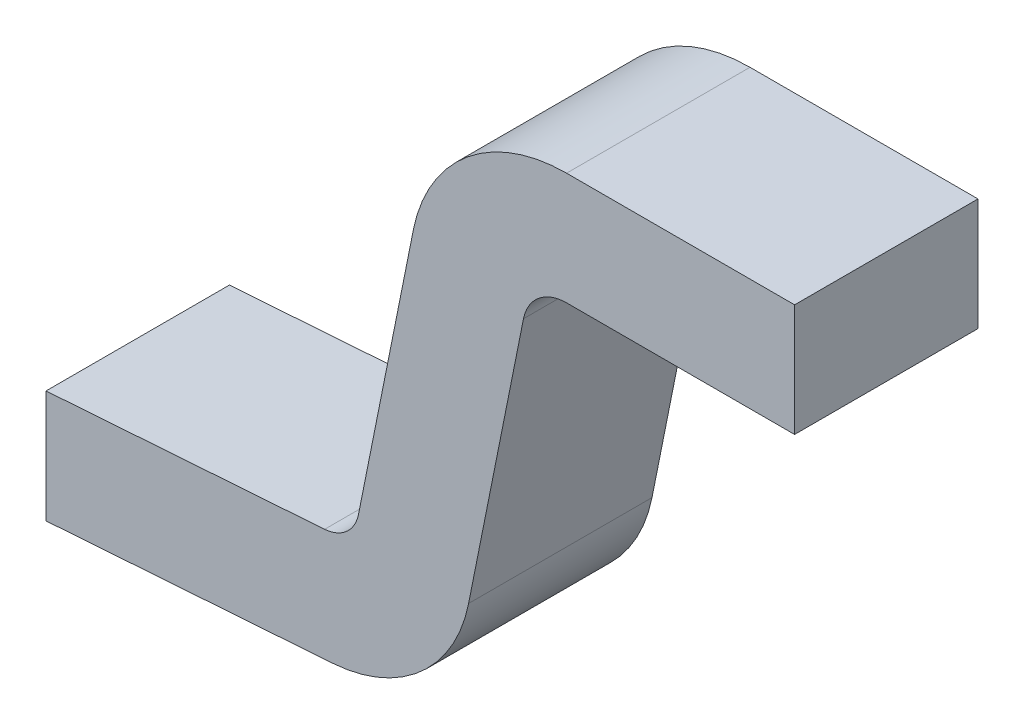
ISO-10303-21;
HEADER;
FILE_DESCRIPTION(('STEP AP214'),'2;1');
FILE_NAME('part.step','',(''),(''),'','','');
FILE_SCHEMA(('AUTOMOTIVE_DESIGN { 1 0 10303 214 1 1 1 1 }'));
ENDSEC;
DATA;
#1=APPLICATION_CONTEXT('core data for automotive mechanical design processes');
#2=APPLICATION_PROTOCOL_DEFINITION('international standard','automotive_design',2000,#1);
#3=PRODUCT_CONTEXT('',#1,'mechanical');
#4=PRODUCT('Part','Part','',(#3));
#5=PRODUCT_RELATED_PRODUCT_CATEGORY('part','',(#4));
#6=PRODUCT_DEFINITION_FORMATION('','',#4);
#7=PRODUCT_DEFINITION_CONTEXT('part definition',#1,'design');
#8=PRODUCT_DEFINITION('design','',#6,#7);
#9=PRODUCT_DEFINITION_SHAPE('','',#8);
#10=(LENGTH_UNIT() NAMED_UNIT(*) SI_UNIT(.MILLI.,.METRE.));
#11=(NAMED_UNIT(*) PLANE_ANGLE_UNIT() SI_UNIT($,.RADIAN.));
#12=(NAMED_UNIT(*) SI_UNIT($,.STERADIAN.) SOLID_ANGLE_UNIT());
#13=UNCERTAINTY_MEASURE_WITH_UNIT(LENGTH_MEASURE(1.E-05),#10,'distance_accuracy_value','');
#14=(GEOMETRIC_REPRESENTATION_CONTEXT(3) GLOBAL_UNCERTAINTY_ASSIGNED_CONTEXT((#13)) GLOBAL_UNIT_ASSIGNED_CONTEXT((#10,
#11,#12)) REPRESENTATION_CONTEXT('',''));
#15=CARTESIAN_POINT('',(0.,0.,0.));
#16=DIRECTION('',(0.,0.,1.));
#17=DIRECTION('',(1.,0.,0.));
#18=AXIS2_PLACEMENT_3D('',#15,#16,#17);
#19=CARTESIAN_POINT('',(-0.127804391765579,-0.198607262984615,0.));
#20=DIRECTION('',(0.069756473744126,-0.997564050259824,0.));
#21=DIRECTION('',(-0.997564050259824,-0.069756473744126,0.));
#22=AXIS2_PLACEMENT_3D('',#19,#20,#21);
#23=PLANE('',#22);
#24=DIRECTION('',(-0.997564050259824,-0.069756473744126,0.));
#25=VECTOR('',#24,1.);
#26=CARTESIAN_POINT('',(-0.127804391765579,-0.198607262984615,0.));
#27=LINE('',#26,#25);
#28=CARTESIAN_POINT('',(-0.127804391765579,-0.198607262984615,0.));
#29=VERTEX_POINT('',#28);
#30=CARTESIAN_POINT('',(-0.5,-0.224633715287824,0.));
#31=VERTEX_POINT('',#30);
#32=EDGE_CURVE('E11',#29,#31,#27,.T.);
#33=ORIENTED_EDGE('',*,*,#32,.F.);
#34=DIRECTION('',(0.,0.,-1.));
#35=VECTOR('',#34,1.);
#36=CARTESIAN_POINT('',(-0.127804391765579,-0.198607262984615,0.));
#37=LINE('',#36,#35);
#38=CARTESIAN_POINT('',(-0.127804391765579,-0.198607262984615,-0.245));
#39=VERTEX_POINT('',#38);
#40=EDGE_CURVE('E23',#29,#39,#37,.T.);
#41=ORIENTED_EDGE('',*,*,#40,.T.);
#42=DIRECTION('',(-0.997564050259824,-0.069756473744126,0.));
#43=VECTOR('',#42,1.);
#44=CARTESIAN_POINT('',(-0.127804391765579,-0.198607262984615,-0.245));
#45=LINE('',#44,#43);
#46=CARTESIAN_POINT('',(-0.5,-0.224633715287824,-0.245));
#47=VERTEX_POINT('',#46);
#48=EDGE_CURVE('E202',#39,#47,#45,.T.);
#49=ORIENTED_EDGE('',*,*,#48,.T.);
#50=DIRECTION('',(0.,0.,-1.));
#51=VECTOR('',#50,1.);
#52=CARTESIAN_POINT('',(-0.5,-0.224633715287824,0.));
#53=LINE('',#52,#51);
#54=EDGE_CURVE('E199',#31,#47,#53,.T.);
#55=ORIENTED_EDGE('',*,*,#54,.F.);
#56=EDGE_LOOP('',(#33,#41,#49,#55));
#57=FACE_BOUND('',#56,.T.);
#58=ADVANCED_FACE('F16',(#57),#23,.F.);
#59=CARTESIAN_POINT('',(-0.131269254830082,-0.149057412673945,0.));
#60=DIRECTION('',(0.,0.,1.));
#61=DIRECTION('',(-0.069756473744126,0.997564050259824,0.));
#62=AXIS2_PLACEMENT_3D('',#59,#60,#61);
#63=CYLINDRICAL_SURFACE('',#62,0.0496708459950664);
#64=CARTESIAN_POINT('',(-0.131269254830082,-0.149057412673945,0.));
#65=DIRECTION('',(0.,0.,-1.));
#66=DIRECTION('',(-0.069756473744126,0.997564050259824,0.));
#67=AXIS2_PLACEMENT_3D('',#64,#65,#66);
#68=CIRCLE('',#67,0.0496708459950664);
#69=CARTESIAN_POINT('',(-0.0825658942513528,-0.158813211472806,0.));
#70=VERTEX_POINT('',#69);
#71=EDGE_CURVE('E197',#70,#29,#68,.T.);
#72=ORIENTED_EDGE('',*,*,#71,.F.);
#73=DIRECTION('',(0.,0.,-1.));
#74=VECTOR('',#73,1.);
#75=CARTESIAN_POINT('',(-0.0825658942513528,-0.158813211472806,0.));
#76=LINE('',#75,#74);
#77=CARTESIAN_POINT('',(-0.0825658942513528,-0.158813211472806,-0.245));
#78=VERTEX_POINT('',#77);
#79=EDGE_CURVE('E194',#70,#78,#76,.T.);
#80=ORIENTED_EDGE('',*,*,#79,.T.);
#81=CARTESIAN_POINT('',(-0.131269254830082,-0.149057412673945,-0.245));
#82=DIRECTION('',(0.,0.,-1.));
#83=DIRECTION('',(-0.069756473744126,0.997564050259824,0.));
#84=AXIS2_PLACEMENT_3D('',#81,#82,#83);
#85=CIRCLE('',#84,0.0496708459950664);
#86=EDGE_CURVE('E191',#78,#39,#85,.T.);
#87=ORIENTED_EDGE('',*,*,#86,.T.);
#88=ORIENTED_EDGE('',*,*,#40,.F.);
#89=EDGE_LOOP('',(#72,#80,#87,#88));
#90=FACE_BOUND('',#89,.T.);
#91=ADVANCED_FACE('F208',(#90),#63,.F.);
#92=CARTESIAN_POINT('',(-0.00923430841156182,0.207276202690008,0.));
#93=DIRECTION('',(0.980522066879372,-0.196408951839279,0.));
#94=DIRECTION('',(-0.196408951839279,-0.980522066879372,0.));
#95=AXIS2_PLACEMENT_3D('',#92,#93,#94);
#96=PLANE('',#95);
#97=DIRECTION('',(-0.196408951839279,-0.980522066879372,0.));
#98=VECTOR('',#97,1.);
#99=CARTESIAN_POINT('',(-0.00923430841156182,0.207276202690008,0.));
#100=LINE('',#99,#98);
#101=CARTESIAN_POINT('',(-0.00923430841156182,0.207276202690008,0.));
#102=VERTEX_POINT('',#101);
#103=EDGE_CURVE('E188',#102,#70,#100,.T.);
#104=ORIENTED_EDGE('',*,*,#103,.F.);
#105=DIRECTION('',(0.,0.,-1.));
#106=VECTOR('',#105,1.);
#107=CARTESIAN_POINT('',(-0.00923430841156182,0.207276202690008,0.));
#108=LINE('',#107,#106);
#109=CARTESIAN_POINT('',(-0.00923430841156182,0.207276202690008,-0.245));
#110=VERTEX_POINT('',#109);
#111=EDGE_CURVE('E186',#102,#110,#108,.T.);
#112=ORIENTED_EDGE('',*,*,#111,.T.);
#113=DIRECTION('',(-0.196408951839279,-0.980522066879372,0.));
#114=VECTOR('',#113,1.);
#115=CARTESIAN_POINT('',(-0.00923430841156182,0.207276202690008,-0.245));
#116=LINE('',#115,#114);
#117=EDGE_CURVE('E183',#110,#78,#116,.T.);
#118=ORIENTED_EDGE('',*,*,#117,.T.);
#119=ORIENTED_EDGE('',*,*,#79,.F.);
#120=EDGE_LOOP('',(#104,#112,#118,#119));
#121=FACE_BOUND('',#120,.T.);
#122=ADVANCED_FACE('F210',(#121),#96,.F.);
#123=CARTESIAN_POINT('',(0.195418151044853,0.166282148184849,0.));
#124=DIRECTION('',(0.,0.,1.));
#125=DIRECTION('',(0.,1.,0.));
#126=AXIS2_PLACEMENT_3D('',#123,#124,#125);
#127=CYLINDRICAL_SURFACE('',#126,0.208717851815151);
#128=CARTESIAN_POINT('',(0.195418151044853,0.166282148184849,0.));
#129=DIRECTION('',(0.,0.,1.));
#130=DIRECTION('',(0.,1.,0.));
#131=AXIS2_PLACEMENT_3D('',#128,#129,#130);
#132=CIRCLE('',#131,0.208717851815151);
#133=CARTESIAN_POINT('',(0.195418151044853,0.375,0.));
#134=VERTEX_POINT('',#133);
#135=EDGE_CURVE('E180',#134,#102,#132,.T.);
#136=ORIENTED_EDGE('',*,*,#135,.F.);
#137=DIRECTION('',(0.,0.,-1.));
#138=VECTOR('',#137,1.);
#139=CARTESIAN_POINT('',(0.195418151044853,0.375,0.));
#140=LINE('',#139,#138);
#141=CARTESIAN_POINT('',(0.195418151044853,0.375,-0.245));
#142=VERTEX_POINT('',#141);
#143=EDGE_CURVE('E178',#134,#142,#140,.T.);
#144=ORIENTED_EDGE('',*,*,#143,.T.);
#145=CARTESIAN_POINT('',(0.195418151044853,0.166282148184849,-0.245));
#146=DIRECTION('',(0.,0.,1.));
#147=DIRECTION('',(0.,1.,0.));
#148=AXIS2_PLACEMENT_3D('',#145,#146,#147);
#149=CIRCLE('',#148,0.208717851815151);
#150=EDGE_CURVE('E126',#142,#110,#149,.T.);
#151=ORIENTED_EDGE('',*,*,#150,.T.);
#152=ORIENTED_EDGE('',*,*,#111,.F.);
#153=EDGE_LOOP('',(#136,#144,#151,#152));
#154=FACE_BOUND('',#153,.T.);
#155=ADVANCED_FACE('F213',(#154),#127,.T.);
#156=CARTESIAN_POINT('',(0.195418151044853,0.166282148184849,0.));
#157=DIRECTION('',(0.,0.,1.));
#158=DIRECTION('',(0.,-1.,0.));
#159=AXIS2_PLACEMENT_3D('',#156,#157,#158);
#160=CYLINDRICAL_SURFACE('',#159,0.0587178518151513);
#161=CARTESIAN_POINT('',(0.195418151044853,0.166282148184849,0.));
#162=DIRECTION('',(0.,0.,-1.));
#163=DIRECTION('',(0.,-1.,0.));
#164=AXIS2_PLACEMENT_3D('',#161,#162,#163);
#165=CIRCLE('',#164,0.0587178518151513);
#166=CARTESIAN_POINT('',(0.137844001620344,0.177814859914117,0.));
#167=VERTEX_POINT('',#166);
#168=CARTESIAN_POINT('',(0.195418151044853,0.225,0.));
#169=VERTEX_POINT('',#168);
#170=EDGE_CURVE('E174',#167,#169,#165,.T.);
#171=ORIENTED_EDGE('',*,*,#170,.F.);
#172=DIRECTION('',(0.,0.,-1.));
#173=VECTOR('',#172,1.);
#174=CARTESIAN_POINT('',(0.137844001620344,0.177814859914117,0.));
#175=LINE('',#174,#173);
#176=CARTESIAN_POINT('',(0.137844001620344,0.177814859914117,-0.245));
#177=VERTEX_POINT('',#176);
#178=EDGE_CURVE('E171',#167,#177,#175,.T.);
#179=ORIENTED_EDGE('',*,*,#178,.T.);
#180=CARTESIAN_POINT('',(0.195418151044853,0.166282148184849,-0.245));
#181=DIRECTION('',(0.,0.,-1.));
#182=DIRECTION('',(0.,-1.,0.));
#183=AXIS2_PLACEMENT_3D('',#180,#181,#182);
#184=CIRCLE('',#183,0.0587178518151513);
#185=CARTESIAN_POINT('',(0.195418151044853,0.225,-0.245));
#186=VERTEX_POINT('',#185);
#187=EDGE_CURVE('E168',#177,#186,#184,.T.);
#188=ORIENTED_EDGE('',*,*,#187,.T.);
#189=DIRECTION('',(0.,0.,-1.));
#190=VECTOR('',#189,1.);
#191=CARTESIAN_POINT('',(0.195418151044853,0.225,0.));
#192=LINE('',#191,#190);
#193=EDGE_CURVE('E166',#169,#186,#192,.T.);
#194=ORIENTED_EDGE('',*,*,#193,.F.);
#195=EDGE_LOOP('',(#171,#179,#188,#194));
#196=FACE_BOUND('',#195,.T.);
#197=ADVANCED_FACE('F222',(#196),#160,.F.);
#198=CARTESIAN_POINT('',(0.0645124157805532,-0.188274554248698,0.));
#199=DIRECTION('',(-0.980522066879372,0.196408951839279,0.));
#200=DIRECTION('',(0.196408951839279,0.980522066879372,0.));
#201=AXIS2_PLACEMENT_3D('',#198,#199,#200);
#202=PLANE('',#201);
#203=DIRECTION('',(0.196408951839278,0.980522066879372,0.));
#204=VECTOR('',#203,1.);
#205=CARTESIAN_POINT('',(0.0645124157805532,-0.188274554248698,0.));
#206=LINE('',#205,#204);
#207=CARTESIAN_POINT('',(0.0645124157805532,-0.188274554248698,0.));
#208=VERTEX_POINT('',#207);
#209=EDGE_CURVE('E163',#208,#167,#206,.T.);
#210=ORIENTED_EDGE('',*,*,#209,.F.);
#211=DIRECTION('',(0.,0.,-1.));
#212=VECTOR('',#211,1.);
#213=CARTESIAN_POINT('',(0.0645124157805532,-0.188274554248698,0.));
#214=LINE('',#213,#212);
#215=CARTESIAN_POINT('',(0.0645124157805532,-0.188274554248698,-0.245));
#216=VERTEX_POINT('',#215);
#217=EDGE_CURVE('E161',#208,#216,#214,.T.);
#218=ORIENTED_EDGE('',*,*,#217,.T.);
#219=DIRECTION('',(0.196408951839278,0.980522066879372,0.));
#220=VECTOR('',#219,1.);
#221=CARTESIAN_POINT('',(0.0645124157805532,-0.188274554248698,-0.245));
#222=LINE('',#221,#220);
#223=EDGE_CURVE('E158',#216,#177,#222,.T.);
#224=ORIENTED_EDGE('',*,*,#223,.T.);
#225=ORIENTED_EDGE('',*,*,#178,.F.);
#226=EDGE_LOOP('',(#210,#218,#224,#225));
#227=FACE_BOUND('',#226,.T.);
#228=ADVANCED_FACE('F224',(#227),#202,.F.);
#229=CARTESIAN_POINT('',(-0.131269254830082,-0.149057412673945,0.));
#230=DIRECTION('',(0.,0.,1.));
#231=DIRECTION('',(0.069756473744126,-0.997564050259824,0.));
#232=AXIS2_PLACEMENT_3D('',#229,#230,#231);
#233=CYLINDRICAL_SURFACE('',#232,0.199670845995066);
#234=CARTESIAN_POINT('',(-0.131269254830082,-0.149057412673945,0.));
#235=DIRECTION('',(0.,0.,1.));
#236=DIRECTION('',(0.069756473744126,-0.997564050259824,0.));
#237=AXIS2_PLACEMENT_3D('',#234,#235,#236);
#238=CIRCLE('',#237,0.199670845995066);
#239=CARTESIAN_POINT('',(-0.11734092070396,-0.348241870523589,0.));
#240=VERTEX_POINT('',#239);
#241=EDGE_CURVE('E155',#240,#208,#238,.T.);
#242=ORIENTED_EDGE('',*,*,#241,.F.);
#243=DIRECTION('',(0.,0.,-1.));
#244=VECTOR('',#243,1.);
#245=CARTESIAN_POINT('',(-0.11734092070396,-0.348241870523589,0.));
#246=LINE('',#245,#244);
#247=CARTESIAN_POINT('',(-0.11734092070396,-0.348241870523589,-0.245));
#248=VERTEX_POINT('',#247);
#249=EDGE_CURVE('E153',#240,#248,#246,.T.);
#250=ORIENTED_EDGE('',*,*,#249,.T.);
#251=CARTESIAN_POINT('',(-0.131269254830082,-0.149057412673945,-0.245));
#252=DIRECTION('',(0.,0.,1.));
#253=DIRECTION('',(0.069756473744126,-0.997564050259824,0.));
#254=AXIS2_PLACEMENT_3D('',#251,#252,#253);
#255=CIRCLE('',#254,0.199670845995066);
#256=EDGE_CURVE('E150',#248,#216,#255,.T.);
#257=ORIENTED_EDGE('',*,*,#256,.T.);
#258=ORIENTED_EDGE('',*,*,#217,.F.);
#259=EDGE_LOOP('',(#242,#250,#257,#258));
#260=FACE_BOUND('',#259,.T.);
#261=ADVANCED_FACE('F227',(#260),#233,.T.);
#262=CARTESIAN_POINT('',(-0.5,-0.375,0.));
#263=DIRECTION('',(-0.069756473744126,0.997564050259824,0.));
#264=DIRECTION('',(0.997564050259824,0.069756473744126,0.));
#265=AXIS2_PLACEMENT_3D('',#262,#263,#264);
#266=PLANE('',#265);
#267=DIRECTION('',(0.997564050259824,0.069756473744126,0.));
#268=VECTOR('',#267,1.);
#269=CARTESIAN_POINT('',(-0.5,-0.375,0.));
#270=LINE('',#269,#268);
#271=CARTESIAN_POINT('',(-0.5,-0.375,0.));
#272=VERTEX_POINT('',#271);
#273=EDGE_CURVE('E147',#272,#240,#270,.T.);
#274=ORIENTED_EDGE('',*,*,#273,.F.);
#275=DIRECTION('',(0.,0.,-1.));
#276=VECTOR('',#275,1.);
#277=CARTESIAN_POINT('',(-0.5,-0.375,0.));
#278=LINE('',#277,#276);
#279=CARTESIAN_POINT('',(-0.5,-0.375,-0.245));
#280=VERTEX_POINT('',#279);
#281=EDGE_CURVE('E145',#272,#280,#278,.T.);
#282=ORIENTED_EDGE('',*,*,#281,.T.);
#283=DIRECTION('',(0.997564050259824,0.069756473744126,0.));
#284=VECTOR('',#283,1.);
#285=CARTESIAN_POINT('',(-0.5,-0.375,-0.245));
#286=LINE('',#285,#284);
#287=EDGE_CURVE('E142',#280,#248,#286,.T.);
#288=ORIENTED_EDGE('',*,*,#287,.T.);
#289=ORIENTED_EDGE('',*,*,#249,.F.);
#290=EDGE_LOOP('',(#274,#282,#288,#289));
#291=FACE_BOUND('',#290,.T.);
#292=ADVANCED_FACE('F232',(#291),#266,.F.);
#293=CARTESIAN_POINT('',(-0.5,-0.224633715287824,0.));
#294=DIRECTION('',(1.,0.,0.));
#295=DIRECTION('',(0.,-1.,0.));
#296=AXIS2_PLACEMENT_3D('',#293,#294,#295);
#297=PLANE('',#296);
#298=DIRECTION('',(0.,-1.,0.));
#299=VECTOR('',#298,1.);
#300=CARTESIAN_POINT('',(-0.5,0.375,0.));
#301=LINE('',#300,#299);
#302=EDGE_CURVE('E140',#31,#272,#301,.T.);
#303=ORIENTED_EDGE('',*,*,#302,.F.);
#304=ORIENTED_EDGE('',*,*,#54,.T.);
#305=DIRECTION('',(0.,-1.,0.));
#306=VECTOR('',#305,1.);
#307=CARTESIAN_POINT('',(-0.5,0.375,-0.245));
#308=LINE('',#307,#306);
#309=EDGE_CURVE('E137',#47,#280,#308,.T.);
#310=ORIENTED_EDGE('',*,*,#309,.T.);
#311=ORIENTED_EDGE('',*,*,#281,.F.);
#312=EDGE_LOOP('',(#303,#304,#310,#311));
#313=FACE_BOUND('',#312,.T.);
#314=ADVANCED_FACE('F234',(#313),#297,.F.);
#315=CARTESIAN_POINT('',(0.5,0.225,0.));
#316=DIRECTION('',(-1.,0.,0.));
#317=DIRECTION('',(0.,1.,0.));
#318=AXIS2_PLACEMENT_3D('',#315,#316,#317);
#319=PLANE('',#318);
#320=DIRECTION('',(0.,1.,0.));
#321=VECTOR('',#320,1.);
#322=CARTESIAN_POINT('',(0.5,0.225,0.));
#323=LINE('',#322,#321);
#324=CARTESIAN_POINT('',(0.5,0.225,0.));
#325=VERTEX_POINT('',#324);
#326=CARTESIAN_POINT('',(0.5,0.375,0.));
#327=VERTEX_POINT('',#326);
#328=EDGE_CURVE('E135',#325,#327,#323,.T.);
#329=ORIENTED_EDGE('',*,*,#328,.F.);
#330=DIRECTION('',(0.,0.,-1.));
#331=VECTOR('',#330,1.);
#332=CARTESIAN_POINT('',(0.5,0.225,0.));
#333=LINE('',#332,#331);
#334=CARTESIAN_POINT('',(0.5,0.225,-0.245));
#335=VERTEX_POINT('',#334);
#336=EDGE_CURVE('E107',#325,#335,#333,.T.);
#337=ORIENTED_EDGE('',*,*,#336,.T.);
#338=DIRECTION('',(0.,1.,0.));
#339=VECTOR('',#338,1.);
#340=CARTESIAN_POINT('',(0.5,0.225,-0.245));
#341=LINE('',#340,#339);
#342=CARTESIAN_POINT('',(0.5,0.375,-0.245));
#343=VERTEX_POINT('',#342);
#344=EDGE_CURVE('E101',#335,#343,#341,.T.);
#345=ORIENTED_EDGE('',*,*,#344,.T.);
#346=DIRECTION('',(0.,0.,-1.));
#347=VECTOR('',#346,1.);
#348=CARTESIAN_POINT('',(0.5,0.375,0.));
#349=LINE('',#348,#347);
#350=EDGE_CURVE('E104',#327,#343,#349,.T.);
#351=ORIENTED_EDGE('',*,*,#350,.F.);
#352=EDGE_LOOP('',(#329,#337,#345,#351));
#353=FACE_BOUND('',#352,.T.);
#354=ADVANCED_FACE('F103',(#353),#319,.F.);
#355=CARTESIAN_POINT('',(0.195418151044853,0.225,0.));
#356=DIRECTION('',(0.,1.,0.));
#357=DIRECTION('',(1.,0.,0.));
#358=AXIS2_PLACEMENT_3D('',#355,#356,#357);
#359=PLANE('',#358);
#360=DIRECTION('',(1.,0.,0.));
#361=VECTOR('',#360,1.);
#362=CARTESIAN_POINT('',(0.195418151044853,0.225,0.));
#363=LINE('',#362,#361);
#364=EDGE_CURVE('E120',#169,#325,#363,.T.);
#365=ORIENTED_EDGE('',*,*,#364,.F.);
#366=ORIENTED_EDGE('',*,*,#193,.T.);
#367=DIRECTION('',(1.,0.,0.));
#368=VECTOR('',#367,1.);
#369=CARTESIAN_POINT('',(0.195418151044853,0.225,-0.245));
#370=LINE('',#369,#368);
#371=EDGE_CURVE('E128',#186,#335,#370,.T.);
#372=ORIENTED_EDGE('',*,*,#371,.T.);
#373=ORIENTED_EDGE('',*,*,#336,.F.);
#374=EDGE_LOOP('',(#365,#366,#372,#373));
#375=FACE_BOUND('',#374,.T.);
#376=ADVANCED_FACE('F217',(#375),#359,.F.);
#377=CARTESIAN_POINT('',(0.5,0.375,0.));
#378=DIRECTION('',(0.,-1.,0.));
#379=DIRECTION('',(-1.,0.,0.));
#380=AXIS2_PLACEMENT_3D('',#377,#378,#379);
#381=PLANE('',#380);
#382=DIRECTION('',(-1.,0.,0.));
#383=VECTOR('',#382,1.);
#384=CARTESIAN_POINT('',(0.5,0.375,0.));
#385=LINE('',#384,#383);
#386=EDGE_CURVE('E119',#327,#134,#385,.T.);
#387=ORIENTED_EDGE('',*,*,#386,.F.);
#388=ORIENTED_EDGE('',*,*,#350,.T.);
#389=DIRECTION('',(-1.,0.,0.));
#390=VECTOR('',#389,1.);
#391=CARTESIAN_POINT('',(0.5,0.375,-0.245));
#392=LINE('',#391,#390);
#393=EDGE_CURVE('E117',#343,#142,#392,.T.);
#394=ORIENTED_EDGE('',*,*,#393,.T.);
#395=ORIENTED_EDGE('',*,*,#143,.F.);
#396=EDGE_LOOP('',(#387,#388,#394,#395));
#397=FACE_BOUND('',#396,.T.);
#398=ADVANCED_FACE('F115',(#397),#381,.F.);
#399=CARTESIAN_POINT('',(0.347709075522426,0.3,-0.245));
#400=DIRECTION('',(0.,0.,1.));
#401=DIRECTION('',(1.,0.,0.));
#402=AXIS2_PLACEMENT_3D('',#399,#400,#401);
#403=PLANE('',#402);
#404=ORIENTED_EDGE('',*,*,#393,.F.);
#405=ORIENTED_EDGE('',*,*,#344,.F.);
#406=ORIENTED_EDGE('',*,*,#371,.F.);
#407=ORIENTED_EDGE('',*,*,#187,.F.);
#408=ORIENTED_EDGE('',*,*,#223,.F.);
#409=ORIENTED_EDGE('',*,*,#256,.F.);
#410=ORIENTED_EDGE('',*,*,#287,.F.);
#411=ORIENTED_EDGE('',*,*,#309,.F.);
#412=ORIENTED_EDGE('',*,*,#48,.F.);
#413=ORIENTED_EDGE('',*,*,#86,.F.);
#414=ORIENTED_EDGE('',*,*,#117,.F.);
#415=ORIENTED_EDGE('',*,*,#150,.F.);
#416=EDGE_LOOP('',(#404,#405,#406,#407,#408,#409,#410,#411,#412,#413,#414,#415));
#417=FACE_BOUND('',#416,.T.);
#418=ADVANCED_FACE('F123',(#417),#403,.F.);
#419=CARTESIAN_POINT('',(0.347709075522426,0.3,0.));
#420=DIRECTION('',(0.,0.,1.));
#421=DIRECTION('',(1.,0.,0.));
#422=AXIS2_PLACEMENT_3D('',#419,#420,#421);
#423=PLANE('',#422);
#424=ORIENTED_EDGE('',*,*,#386,.T.);
#425=ORIENTED_EDGE('',*,*,#135,.T.);
#426=ORIENTED_EDGE('',*,*,#103,.T.);
#427=ORIENTED_EDGE('',*,*,#71,.T.);
#428=ORIENTED_EDGE('',*,*,#32,.T.);
#429=ORIENTED_EDGE('',*,*,#302,.T.);
#430=ORIENTED_EDGE('',*,*,#273,.T.);
#431=ORIENTED_EDGE('',*,*,#241,.T.);
#432=ORIENTED_EDGE('',*,*,#209,.T.);
#433=ORIENTED_EDGE('',*,*,#170,.T.);
#434=ORIENTED_EDGE('',*,*,#364,.T.);
#435=ORIENTED_EDGE('',*,*,#328,.T.);
#436=EDGE_LOOP('',(#424,#425,#426,#427,#428,#429,#430,#431,#432,#433,#434,#435));
#437=FACE_BOUND('',#436,.T.);
#438=ADVANCED_FACE('F214',(#437),#423,.T.);
#439=CLOSED_SHELL('',(#58,#91,#122,#155,#197,#228,#261,#292,#314,#354,#376,#398,#418,#438));
#440=MANIFOLD_SOLID_BREP('B1',#439);
#441=ADVANCED_BREP_SHAPE_REPRESENTATION('',(#18,#440),#14);
#442=SHAPE_DEFINITION_REPRESENTATION(#9,#441);
ENDSEC;
END-ISO-10303-21;
